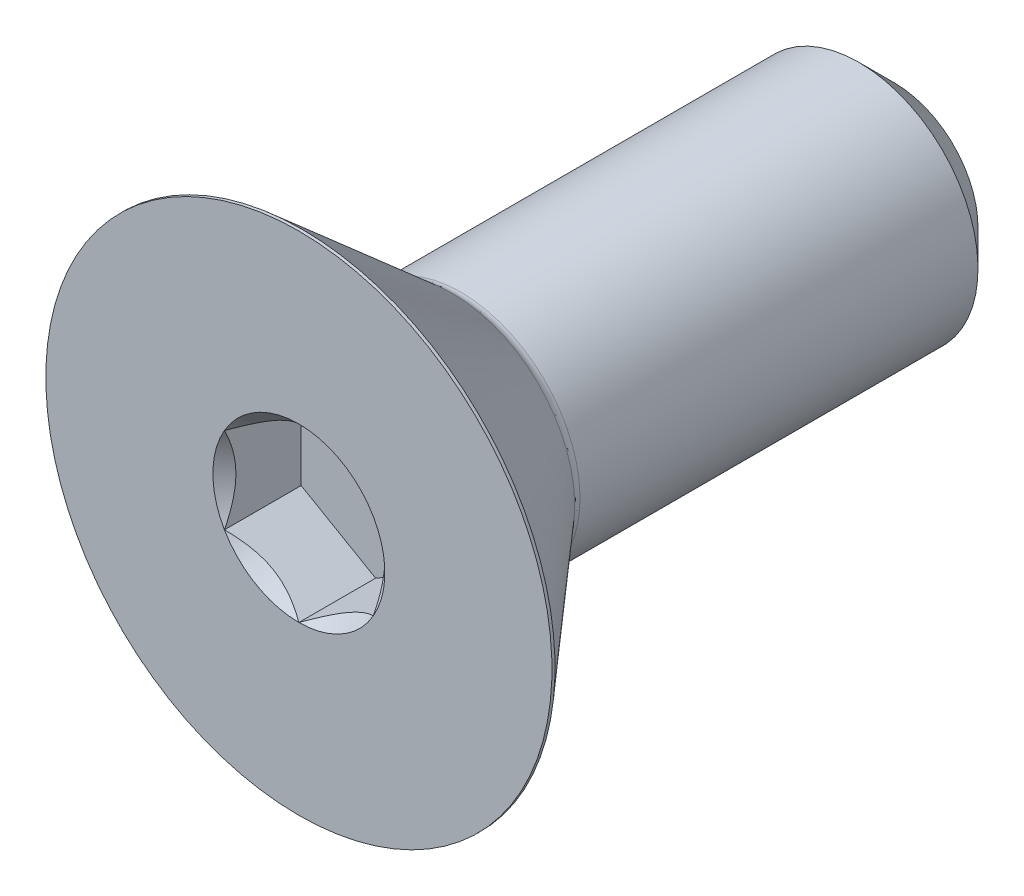
ISO-10303-21;
HEADER;
FILE_DESCRIPTION(('STEP AP214'),'2;1');
FILE_NAME('part.step','',(''),(''),'','','');
FILE_SCHEMA(('AUTOMOTIVE_DESIGN { 1 0 10303 214 1 1 1 1 }'));
ENDSEC;
DATA;
#1=APPLICATION_CONTEXT('core data for automotive mechanical design processes');
#2=APPLICATION_PROTOCOL_DEFINITION('international standard','automotive_design',2000,#1);
#3=PRODUCT_CONTEXT('',#1,'mechanical');
#4=PRODUCT('Part','Part','',(#3));
#5=PRODUCT_RELATED_PRODUCT_CATEGORY('part','',(#4));
#6=PRODUCT_DEFINITION_FORMATION('','',#4);
#7=PRODUCT_DEFINITION_CONTEXT('part definition',#1,'design');
#8=PRODUCT_DEFINITION('design','',#6,#7);
#9=PRODUCT_DEFINITION_SHAPE('','',#8);
#10=(LENGTH_UNIT() NAMED_UNIT(*) SI_UNIT(.MILLI.,.METRE.));
#11=(NAMED_UNIT(*) PLANE_ANGLE_UNIT() SI_UNIT($,.RADIAN.));
#12=(NAMED_UNIT(*) SI_UNIT($,.STERADIAN.) SOLID_ANGLE_UNIT());
#13=UNCERTAINTY_MEASURE_WITH_UNIT(LENGTH_MEASURE(1.E-05),#10,'distance_accuracy_value','');
#14=(GEOMETRIC_REPRESENTATION_CONTEXT(3) GLOBAL_UNCERTAINTY_ASSIGNED_CONTEXT((#13)) GLOBAL_UNIT_ASSIGNED_CONTEXT((#10,
#11,#12)) REPRESENTATION_CONTEXT('',''));
#15=CARTESIAN_POINT('',(0.,0.,0.));
#16=DIRECTION('',(0.,0.,1.));
#17=DIRECTION('',(1.,0.,0.));
#18=AXIS2_PLACEMENT_3D('',#15,#16,#17);
#19=CARTESIAN_POINT('',(0.,0.,7.9375));
#20=DIRECTION('',(0.,0.,1.));
#21=DIRECTION('',(1.,0.,0.));
#22=AXIS2_PLACEMENT_3D('',#19,#20,#21);
#23=CONICAL_SURFACE('',#22,2.29135888084633,0.78539816339745);
#24=CARTESIAN_POINT('',(0.,0.,7.9375));
#25=DIRECTION('',(0.,0.,1.));
#26=DIRECTION('',(1.,0.,0.));
#27=AXIS2_PLACEMENT_3D('',#24,#25,#26);
#28=CIRCLE('',#27,2.29135888084633);
#29=CARTESIAN_POINT('',(0.,-2.29135888084633,7.9375));
#30=VERTEX_POINT('',#29);
#31=CARTESIAN_POINT('',(1.984375,-1.14567944042316,7.9375));
#32=VERTEX_POINT('',#31);
#33=EDGE_CURVE('E238',#30,#32,#28,.T.);
#34=ORIENTED_EDGE('',*,*,#33,.T.);
#35=CARTESIAN_POINT('',(1.984575,-1.14556397036933,7.93761547878184));
#36=CARTESIAN_POINT('',(1.9163590048332,-1.18494849354192,7.89826285226392));
#37=CARTESIAN_POINT('',(1.84700231489303,-1.22499159714897,7.86122131044619));
#38=CARTESIAN_POINT('',(1.70557619954781,-1.30664400291398,7.79339885842332));
#39=CARTESIAN_POINT('',(1.63349332126322,-1.34826107209555,7.76265568909175));
#40=CARTESIAN_POINT('',(1.488141602734,-1.43217992591558,7.70999188881122));
#41=CARTESIAN_POINT('',(1.41490978751306,-1.47446033414663,7.68793887587996));
#42=CARTESIAN_POINT('',(1.2668338174053,-1.55995203534886,7.65396149294388));
#43=CARTESIAN_POINT('',(1.19199418724658,-1.60316071596705,7.64201175609173));
#44=CARTESIAN_POINT('',(1.06301458545619,-1.6776271237807,7.63123009908191));
#45=CARTESIAN_POINT('',(1.00904128422756,-1.7087886237741,7.62963389905907));
#46=CARTESIAN_POINT('',(0.901182881480201,-1.77106070163465,7.63232183886529));
#47=CARTESIAN_POINT('',(0.847297817514478,-1.80217125782056,7.63660804034046));
#48=CARTESIAN_POINT('',(0.740036461751398,-1.86409863044402,7.65081687301352));
#49=CARTESIAN_POINT('',(0.686660807239861,-1.89491507894443,7.66074581045227));
#50=CARTESIAN_POINT('',(0.580832482591105,-1.95601509066828,7.68569508427454));
#51=CARTESIAN_POINT('',(0.5283797420289,-1.9862986945516,7.70071503038949));
#52=CARTESIAN_POINT('',(0.394017661036353,-2.06387267818152,7.74530785163567));
#53=CARTESIAN_POINT('',(0.312941642841676,-2.11068193911104,7.77824299593833));
#54=CARTESIAN_POINT('',(0.193726693270161,-2.17951072233758,7.8338424412022));
#55=CARTESIAN_POINT('',(0.154440075613999,-2.20219286161692,7.85337759205186));
#56=CARTESIAN_POINT('',(0.0765946381319468,-2.24713694590237,7.8942287381194));
#57=CARTESIAN_POINT('',(0.038035388898301,-2.26939913882716,7.91554363956835));
#58=CARTESIAN_POINT('',(-0.000200000000000648,-2.29147435090017,7.93761547878184));
#59=B_SPLINE_CURVE_WITH_KNOTS('',3,(#35,#36,#37,#38,#39,#40,#41,#42,#43,#44,#45,#46,#47,#48,#49,
#50,#51,#52,#53,#54,#55,#56,#57,#58),.UNSPECIFIED.,.F.,.F.,(4,2,2,2,2,2,2,2,2,2,2,4),(0.,
0.264339630306626,0.530219665093693,0.791876416371459,1.05287424418109,1.239639843932,
1.42647091743852,1.61351120244034,1.8005371524754,2.09764209964316,2.24579179873714,
2.39385111134157),.UNSPECIFIED.);
#60=EDGE_CURVE('E11',#32,#30,#59,.T.);
#61=ORIENTED_EDGE('',*,*,#60,.T.);
#62=EDGE_LOOP('',(#34,#61));
#63=FACE_BOUND('',#62,.T.);
#64=ADVANCED_FACE('F39',(#63),#23,.F.);
#65=CARTESIAN_POINT('',(-1.984375,-1.14567944042316,7.9375));
#66=VERTEX_POINT('',#65);
#67=EDGE_CURVE('E243',#66,#30,#28,.T.);
#68=ORIENTED_EDGE('',*,*,#67,.T.);
#69=CARTESIAN_POINT('',(0.000199999999999503,-2.29147435090017,7.93761547878184));
#70=CARTESIAN_POINT('',(-0.0680159951668028,-2.25208982772758,7.89826285226392));
#71=CARTESIAN_POINT('',(-0.137372685106966,-2.21204672412052,7.86122131044619));
#72=CARTESIAN_POINT('',(-0.278798800452188,-2.13039431835551,7.79339885842332));
#73=CARTESIAN_POINT('',(-0.350881678736784,-2.08877724917394,7.76265568909175));
#74=CARTESIAN_POINT('',(-0.496233397266005,-2.00485839535392,7.70999188881122));
#75=CARTESIAN_POINT('',(-0.56946521248694,-1.96257798712287,7.68793887587996));
#76=CARTESIAN_POINT('',(-0.717541182594708,-1.87708628592063,7.65396149294388));
#77=CARTESIAN_POINT('',(-0.792380812753426,-1.83387760530244,7.64201175609173));
#78=CARTESIAN_POINT('',(-0.921360414543817,-1.75941119748879,7.63123009908191));
#79=CARTESIAN_POINT('',(-0.975333715772444,-1.72824969749539,7.62963389905907));
#80=CARTESIAN_POINT('',(-1.0831921185198,-1.66597761963484,7.63232183886529));
#81=CARTESIAN_POINT('',(-1.13707718248553,-1.63486706344893,7.63660804034046));
#82=CARTESIAN_POINT('',(-1.24433853824861,-1.57293969082547,7.65081687301352));
#83=CARTESIAN_POINT('',(-1.29771419276014,-1.54212324232506,7.66074581045227));
#84=CARTESIAN_POINT('',(-1.4035425174089,-1.48102323060122,7.68569508427454));
#85=CARTESIAN_POINT('',(-1.4559952579711,-1.45073962671789,7.70071503038949));
#86=CARTESIAN_POINT('',(-1.59035733896365,-1.37316564308797,7.74530785163567));
#87=CARTESIAN_POINT('',(-1.67143335715833,-1.32635638215845,7.77824299593833));
#88=CARTESIAN_POINT('',(-1.79064830672984,-1.25752759893191,7.8338424412022));
#89=CARTESIAN_POINT('',(-1.829934924386,-1.23484545965257,7.85337759205186));
#90=CARTESIAN_POINT('',(-1.90778036186805,-1.18990137536713,7.8942287381194));
#91=CARTESIAN_POINT('',(-1.9463396111017,-1.16763918244233,7.91554363956835));
#92=CARTESIAN_POINT('',(-1.984575,-1.14556397036933,7.93761547878184));
#93=B_SPLINE_CURVE_WITH_KNOTS('',3,(#69,#70,#71,#72,#73,#74,#75,#76,#77,#78,#79,#80,#81,#82,#83,
#84,#85,#86,#87,#88,#89,#90,#91,#92),.UNSPECIFIED.,.F.,.F.,(4,2,2,2,2,2,2,2,2,2,2,4),(0.,
0.264339630306627,0.530219665093695,0.791876416371461,1.05287424418109,1.239639843932,
1.42647091743852,1.61351120244035,1.80053715247541,2.09764209964316,2.24579179873714,
2.39385111134157),.UNSPECIFIED.);
#94=EDGE_CURVE('E53',#30,#66,#93,.T.);
#95=ORIENTED_EDGE('',*,*,#94,.T.);
#96=EDGE_LOOP('',(#68,#95));
#97=FACE_BOUND('',#96,.T.);
#98=ADVANCED_FACE('F228',(#97),#23,.F.);
#99=CARTESIAN_POINT('',(-1.984375,1.14567944042316,7.9375));
#100=VERTEX_POINT('',#99);
#101=EDGE_CURVE('E244',#100,#66,#28,.T.);
#102=ORIENTED_EDGE('',*,*,#101,.T.);
#103=CARTESIAN_POINT('',(-1.984375,-2.30930117448047,8.69090975651873));
#104=CARTESIAN_POINT('',(-1.984375,-2.25318066067427,8.64835431114607));
#105=CARTESIAN_POINT('',(-1.984375,-2.19674863292914,8.60620381978094));
#106=CARTESIAN_POINT('',(-1.984375,-2.08313770997735,8.52289293166334));
#107=CARTESIAN_POINT('',(-1.984375,-2.02595863330381,8.48173278264532));
#108=CARTESIAN_POINT('',(-1.984375,-1.91031146112746,8.40028994336285));
#109=CARTESIAN_POINT('',(-1.984375,-1.85183681291918,8.36001651479088));
#110=CARTESIAN_POINT('',(-1.984375,-1.73389897289164,8.28095506636812));
#111=CARTESIAN_POINT('',(-1.984375,-1.67443585088826,8.24216694224425));
#112=CARTESIAN_POINT('',(-1.984375,-1.48730697426244,8.12404893829194));
#113=CARTESIAN_POINT('',(-1.984375,-1.35764525006195,8.04782578623951));
#114=CARTESIAN_POINT('',(-1.984375,-1.09182473225155,7.90824026842669));
#115=CARTESIAN_POINT('',(-1.984375,-0.955689850924905,7.84483451681397));
#116=CARTESIAN_POINT('',(-1.984375,-0.751579681756423,7.76725639233767));
#117=CARTESIAN_POINT('',(-1.984375,-0.686679364431164,7.74503222861747));
#118=CARTESIAN_POINT('',(-1.984375,-0.555290823919295,7.70579140154786));
#119=CARTESIAN_POINT('',(-1.984375,-0.488802493715647,7.68877509023194));
#120=CARTESIAN_POINT('',(-1.984375,-0.35575770023226,7.66112428459052));
#121=CARTESIAN_POINT('',(-1.984375,-0.28922464265734,7.6503789491865));
#122=CARTESIAN_POINT('',(-1.984375,-0.155420132211981,7.63548382999268));
#123=CARTESIAN_POINT('',(-1.984375,-0.088148814201498,7.63133286114049));
#124=CARTESIAN_POINT('',(-1.984375,0.0439171579492899,7.62994504780904));
#125=CARTESIAN_POINT('',(-1.984375,0.108709202886916,7.63245250973426));
#126=CARTESIAN_POINT('',(-1.984375,0.237749869781508,7.64367340661066));
#127=CARTESIAN_POINT('',(-1.984375,0.301998439086573,7.65238743604135));
#128=CARTESIAN_POINT('',(-1.984375,0.430575076453288,7.67568953552594));
#129=CARTESIAN_POINT('',(-1.984375,0.494884590137217,7.69037842180613));
#130=CARTESIAN_POINT('',(-1.984375,0.622095496453364,7.72484221936127));
#131=CARTESIAN_POINT('',(-1.984375,0.684996997985222,7.74461673581143));
#132=CARTESIAN_POINT('',(-1.984375,0.88193610809939,7.81399789012513));
#133=CARTESIAN_POINT('',(-1.984375,1.01319755610918,7.87146047974145));
#134=CARTESIAN_POINT('',(-1.984375,1.26957386346612,7.99925178211845));
#135=CARTESIAN_POINT('',(-1.984375,1.39466464892634,8.06962649809791));
#136=CARTESIAN_POINT('',(-1.984375,1.5754711384894,8.17946869634988));
#137=CARTESIAN_POINT('',(-1.984375,1.63314521765824,8.21577557709467));
#138=CARTESIAN_POINT('',(-1.984375,1.74750339930581,8.28992795937257));
#139=CARTESIAN_POINT('',(-1.984375,1.80418742651566,8.32777357716684));
#140=CARTESIAN_POINT('',(-1.984375,1.91623595715125,8.40441000309552));
#141=CARTESIAN_POINT('',(-1.984375,1.97160742940914,8.44319067319145));
#142=CARTESIAN_POINT('',(-1.984375,2.0815928647001,8.52178133067531));
#143=CARTESIAN_POINT('',(-1.984375,2.13620703201304,8.56159103184811));
#144=CARTESIAN_POINT('',(-1.984375,2.19050397778737,8.60182239718879));
#145=B_SPLINE_CURVE_WITH_KNOTS('',3,(#103,#104,#105,#106,#107,#108,#109,#110,#111,#112,#113,
#114,#115,#116,#117,#118,#119,#120,#121,#122,#123,#124,#125,#126,#127,#128,#129,#130,#131,#132,
#133,#134,#135,#136,#137,#138,#139,#140,#141,#142,#143,#144),.UNSPECIFIED.,.F.,.F.,(4,2,2,2,2,2,
2,2,2,2,2,2,2,2,2,2,2,2,2,2,4),(0.,0.21129516542495,0.422642648151293,0.635626568171779,
0.848595508530639,1.29943391048318,1.74871972009351,1.95434592439722,2.15998602527965,
2.36187175164808,2.56372119337007,2.75793244551154,2.95216230216181,3.14981522249795,
3.34745280260615,3.77606500436223,4.2062350092677,4.4106671919865,4.61511484963914,
4.81790661958449,5.02064257931148),.UNSPECIFIED.);
#146=EDGE_CURVE('E202',#66,#100,#145,.T.);
#147=ORIENTED_EDGE('',*,*,#146,.T.);
#148=EDGE_LOOP('',(#102,#147));
#149=FACE_BOUND('',#148,.T.);
#150=ADVANCED_FACE('F234',(#149),#23,.F.);
#151=CARTESIAN_POINT('',(0.,2.29135888084633,7.9375));
#152=VERTEX_POINT('',#151);
#153=EDGE_CURVE('E146',#152,#100,#28,.T.);
#154=ORIENTED_EDGE('',*,*,#153,.T.);
#155=CARTESIAN_POINT('',(-1.984575,1.14556397036933,7.93761547878184));
#156=CARTESIAN_POINT('',(-1.9163590048332,1.18494849354192,7.89826285226392));
#157=CARTESIAN_POINT('',(-1.84700231489304,1.22499159714897,7.86122131044619));
#158=CARTESIAN_POINT('',(-1.70557619954781,1.30664400291398,7.79339885842332));
#159=CARTESIAN_POINT('',(-1.63349332126322,1.34826107209555,7.76265568909175));
#160=CARTESIAN_POINT('',(-1.488141602734,1.43217992591557,7.70999188881121));
#161=CARTESIAN_POINT('',(-1.41490978751306,1.47446033414663,7.68793887587996));
#162=CARTESIAN_POINT('',(-1.26683381740529,1.55995203534886,7.65396149294388));
#163=CARTESIAN_POINT('',(-1.19199418724658,1.60316071596705,7.64201175609173));
#164=CARTESIAN_POINT('',(-1.06301458545618,1.6776271237807,7.63123009908191));
#165=CARTESIAN_POINT('',(-1.00904128422756,1.7087886237741,7.62963389905907));
#166=CARTESIAN_POINT('',(-0.9011828814802,1.77106070163465,7.63232183886529));
#167=CARTESIAN_POINT('',(-0.847297817514477,1.80217125782056,7.63660804034046));
#168=CARTESIAN_POINT('',(-0.740036461751396,1.86409863044402,7.65081687301352));
#169=CARTESIAN_POINT('',(-0.686660807239859,1.89491507894443,7.66074581045227));
#170=CARTESIAN_POINT('',(-0.580832482591103,1.95601509066828,7.68569508427454));
#171=CARTESIAN_POINT('',(-0.528379742028898,1.9862986945516,7.70071503038949));
#172=CARTESIAN_POINT('',(-0.394017661036351,2.06387267818152,7.74530785163567));
#173=CARTESIAN_POINT('',(-0.312941642841676,2.11068193911104,7.77824299593833));
#174=CARTESIAN_POINT('',(-0.193726693270161,2.17951072233758,7.8338424412022));
#175=CARTESIAN_POINT('',(-0.154440075614,2.20219286161692,7.85337759205186));
#176=CARTESIAN_POINT('',(-0.0765946381319484,2.24713694590237,7.8942287381194));
#177=CARTESIAN_POINT('',(-0.0380353888983023,2.26939913882716,7.91554363956835));
#178=CARTESIAN_POINT('',(0.000199999999998974,2.29147435090017,7.93761547878184));
#179=B_SPLINE_CURVE_WITH_KNOTS('',3,(#155,#156,#157,#158,#159,#160,#161,#162,#163,#164,#165,
#166,#167,#168,#169,#170,#171,#172,#173,#174,#175,#176,#177,#178),.UNSPECIFIED.,.F.,.F.,(4,2,2,
2,2,2,2,2,2,2,2,4),(0.,0.264339630306626,0.530219665093694,0.791876416371461,1.05287424418109,
1.239639843932,1.42647091743852,1.61351120244035,1.8005371524754,2.09764209964316,
2.24579179873713,2.39385111134157),.UNSPECIFIED.);
#180=EDGE_CURVE('E110',#100,#152,#179,.T.);
#181=ORIENTED_EDGE('',*,*,#180,.T.);
#182=EDGE_LOOP('',(#154,#181));
#183=FACE_BOUND('',#182,.T.);
#184=ADVANCED_FACE('F257',(#183),#23,.F.);
#185=CARTESIAN_POINT('',(1.984375,1.14567944042316,7.9375));
#186=VERTEX_POINT('',#185);
#187=EDGE_CURVE('E142',#186,#152,#28,.T.);
#188=ORIENTED_EDGE('',*,*,#187,.T.);
#189=CARTESIAN_POINT('',(-0.000200000000000999,2.29147435090017,7.93761547878184));
#190=CARTESIAN_POINT('',(0.0680159951668019,2.25208982772757,7.89826285226391));
#191=CARTESIAN_POINT('',(0.137372685106966,2.21204672412052,7.86122131044618));
#192=CARTESIAN_POINT('',(0.278798800452187,2.13039431835551,7.79339885842332));
#193=CARTESIAN_POINT('',(0.350881678736782,2.08877724917394,7.76265568909175));
#194=CARTESIAN_POINT('',(0.496233397266003,2.00485839535392,7.70999188881121));
#195=CARTESIAN_POINT('',(0.569465212486938,1.96257798712287,7.68793887587996));
#196=CARTESIAN_POINT('',(0.717541182594705,1.87708628592063,7.65396149294388));
#197=CARTESIAN_POINT('',(0.792380812753424,1.83387760530244,7.64201175609173));
#198=CARTESIAN_POINT('',(0.921360414543815,1.75941119748879,7.6312300990819));
#199=CARTESIAN_POINT('',(0.975333715772441,1.72824969749539,7.62963389905907));
#200=CARTESIAN_POINT('',(1.0831921185198,1.66597761963484,7.63232183886529));
#201=CARTESIAN_POINT('',(1.13707718248552,1.63486706344893,7.63660804034046));
#202=CARTESIAN_POINT('',(1.2443385382486,1.57293969082547,7.65081687301352));
#203=CARTESIAN_POINT('',(1.29771419276014,1.54212324232506,7.66074581045227));
#204=CARTESIAN_POINT('',(1.4035425174089,1.48102323060122,7.68569508427454));
#205=CARTESIAN_POINT('',(1.4559952579711,1.45073962671789,7.70071503038949));
#206=CARTESIAN_POINT('',(1.59035733896365,1.37316564308797,7.74530785163567));
#207=CARTESIAN_POINT('',(1.67143335715832,1.32635638215845,7.77824299593833));
#208=CARTESIAN_POINT('',(1.79064830672984,1.25752759893191,7.8338424412022));
#209=CARTESIAN_POINT('',(1.829934924386,1.23484545965257,7.85337759205186));
#210=CARTESIAN_POINT('',(1.90778036186805,1.18990137536713,7.8942287381194));
#211=CARTESIAN_POINT('',(1.9463396111017,1.16763918244233,7.91554363956835));
#212=CARTESIAN_POINT('',(1.984575,1.14556397036933,7.93761547878184));
#213=B_SPLINE_CURVE_WITH_KNOTS('',3,(#189,#190,#191,#192,#193,#194,#195,#196,#197,#198,#199,
#200,#201,#202,#203,#204,#205,#206,#207,#208,#209,#210,#211,#212),.UNSPECIFIED.,.F.,.F.,(4,2,2,
2,2,2,2,2,2,2,2,4),(0.,0.264339630306628,0.530219665093694,0.79187641637146,1.05287424418109,
1.239639843932,1.42647091743852,1.61351120244035,1.8005371524754,2.09764209964316,
2.24579179873714,2.39385111134157),.UNSPECIFIED.);
#214=EDGE_CURVE('E172',#152,#186,#213,.T.);
#215=ORIENTED_EDGE('',*,*,#214,.T.);
#216=EDGE_LOOP('',(#188,#215));
#217=FACE_BOUND('',#216,.T.);
#218=ADVANCED_FACE('F189',(#217),#23,.F.);
#219=CARTESIAN_POINT('',(0.,0.,-7.9375));
#220=DIRECTION('',(0.,0.,-1.));
#221=DIRECTION('',(0.,1.,0.));
#222=AXIS2_PLACEMENT_3D('',#219,#220,#221);
#223=CYLINDRICAL_SURFACE('',#222,6.74370000000002);
#224=CARTESIAN_POINT('',(0.,0.,7.9375));
#225=DIRECTION('',(0.,0.,-1.));
#226=DIRECTION('',(0.,1.,0.));
#227=AXIS2_PLACEMENT_3D('',#224,#225,#226);
#228=CIRCLE('',#227,6.74370000000002);
#229=CARTESIAN_POINT('',(0.,6.7437,7.9375));
#230=VERTEX_POINT('',#229);
#231=EDGE_CURVE('E161',#230,#230,#228,.T.);
#232=ORIENTED_EDGE('',*,*,#231,.T.);
#233=EDGE_LOOP('',(#232));
#234=FACE_BOUND('',#233,.T.);
#235=CARTESIAN_POINT('',(0.,0.,7.855712));
#236=DIRECTION('',(0.,0.,-1.));
#237=DIRECTION('',(0.,1.,0.));
#238=AXIS2_PLACEMENT_3D('',#235,#236,#237);
#239=CIRCLE('',#238,6.74370000000002);
#240=CARTESIAN_POINT('',(0.,6.7437,7.855712));
#241=VERTEX_POINT('',#240);
#242=EDGE_CURVE('E145',#241,#241,#239,.T.);
#243=ORIENTED_EDGE('',*,*,#242,.F.);
#244=EDGE_LOOP('',(#243));
#245=FACE_BOUND('',#244,.T.);
#246=ADVANCED_FACE('F41',(#234,#245),#223,.T.);
#247=CARTESIAN_POINT('',(0.,0.,7.9375));
#248=DIRECTION('',(0.,0.,1.));
#249=DIRECTION('',(0.,-1.,0.));
#250=AXIS2_PLACEMENT_3D('',#247,#248,#249);
#251=PLANE('',#250);
#252=ORIENTED_EDGE('',*,*,#187,.F.);
#253=EDGE_CURVE('E135',#32,#186,#28,.T.);
#254=ORIENTED_EDGE('',*,*,#253,.F.);
#255=ORIENTED_EDGE('',*,*,#33,.F.);
#256=ORIENTED_EDGE('',*,*,#67,.F.);
#257=ORIENTED_EDGE('',*,*,#101,.F.);
#258=ORIENTED_EDGE('',*,*,#153,.F.);
#259=EDGE_LOOP('',(#252,#254,#255,#256,#257,#258));
#260=FACE_BOUND('',#259,.T.);
#261=ORIENTED_EDGE('',*,*,#231,.F.);
#262=EDGE_LOOP('',(#261));
#263=FACE_BOUND('',#262,.T.);
#264=ADVANCED_FACE('F248',(#260,#263),#251,.T.);
#265=CARTESIAN_POINT('',(0.,2.22249999999999,-7.9375));
#266=DIRECTION('',(0.,0.,-1.));
#267=DIRECTION('',(0.,1.,0.));
#268=AXIS2_PLACEMENT_3D('',#265,#266,#267);
#269=PLANE('',#268);
#270=CARTESIAN_POINT('',(0.,0.,-7.9375));
#271=DIRECTION('',(0.,0.,-1.));
#272=DIRECTION('',(0.,1.,0.));
#273=AXIS2_PLACEMENT_3D('',#270,#271,#272);
#274=CIRCLE('',#273,2.22250000000001);
#275=CARTESIAN_POINT('',(0.,2.22249999999999,-7.9375));
#276=VERTEX_POINT('',#275);
#277=EDGE_CURVE('E158',#276,#276,#274,.T.);
#278=ORIENTED_EDGE('',*,*,#277,.T.);
#279=EDGE_LOOP('',(#278));
#280=FACE_BOUND('',#279,.T.);
#281=ADVANCED_FACE('F317',(#280),#269,.T.);
#282=CARTESIAN_POINT('',(0.,0.,-7.9375));
#283=DIRECTION('',(0.,0.,1.));
#284=DIRECTION('',(0.,-1.,0.));
#285=AXIS2_PLACEMENT_3D('',#282,#283,#284);
#286=CONICAL_SURFACE('',#285,2.22250000000001,0.785398163397453);
#287=CARTESIAN_POINT('',(0.,0.,-6.985));
#288=DIRECTION('',(0.,0.,-1.));
#289=DIRECTION('',(0.,1.,0.));
#290=AXIS2_PLACEMENT_3D('',#287,#288,#289);
#291=CIRCLE('',#290,3.17500000000002);
#292=CARTESIAN_POINT('',(0.,3.175,-6.985));
#293=VERTEX_POINT('',#292);
#294=EDGE_CURVE('E155',#293,#293,#291,.T.);
#295=ORIENTED_EDGE('',*,*,#294,.T.);
#296=EDGE_LOOP('',(#295));
#297=FACE_BOUND('',#296,.T.);
#298=ORIENTED_EDGE('',*,*,#277,.F.);
#299=EDGE_LOOP('',(#298));
#300=FACE_BOUND('',#299,.T.);
#301=ADVANCED_FACE('F330',(#297,#300),#286,.T.);
#302=CARTESIAN_POINT('',(0.,0.,-7.9375));
#303=DIRECTION('',(0.,0.,-1.));
#304=DIRECTION('',(0.,1.,0.));
#305=AXIS2_PLACEMENT_3D('',#302,#303,#304);
#306=CYLINDRICAL_SURFACE('',#305,3.17500000000002);
#307=CARTESIAN_POINT('',(0.,0.,3.62092824692399));
#308=DIRECTION('',(0.,0.,-1.));
#309=DIRECTION('',(0.,1.,0.));
#310=AXIS2_PLACEMENT_3D('',#307,#308,#309);
#311=CIRCLE('',#310,3.17500000000002);
#312=CARTESIAN_POINT('',(0.,3.175,3.62092824692399));
#313=VERTEX_POINT('',#312);
#314=EDGE_CURVE('E152',#313,#313,#311,.T.);
#315=ORIENTED_EDGE('',*,*,#314,.T.);
#316=EDGE_LOOP('',(#315));
#317=FACE_BOUND('',#316,.T.);
#318=ORIENTED_EDGE('',*,*,#294,.F.);
#319=EDGE_LOOP('',(#318));
#320=FACE_BOUND('',#319,.T.);
#321=ADVANCED_FACE('F338',(#317,#320),#306,.T.);
#322=CARTESIAN_POINT('',(0.,0.,3.62092824692399));
#323=DIRECTION('',(0.,0.,-1.));
#324=DIRECTION('',(0.,1.,0.));
#325=AXIS2_PLACEMENT_3D('',#322,#323,#324);
#326=TOROIDAL_SURFACE('',#325,3.5212672458385,0.346267245838482);
#327=CARTESIAN_POINT('',(0.,0.,3.8481));
#328=DIRECTION('',(0.,0.,-1.));
#329=DIRECTION('',(0.,1.,0.));
#330=AXIS2_PLACEMENT_3D('',#327,#328,#329);
#331=CIRCLE('',#330,3.25993603808684);
#332=CARTESIAN_POINT('',(0.,3.25993603808683,3.8481));
#333=VERTEX_POINT('',#332);
#334=EDGE_CURVE('E149',#333,#333,#331,.T.);
#335=ORIENTED_EDGE('',*,*,#334,.T.);
#336=EDGE_LOOP('',(#335));
#337=FACE_BOUND('',#336,.T.);
#338=ORIENTED_EDGE('',*,*,#314,.F.);
#339=EDGE_LOOP('',(#338));
#340=FACE_BOUND('',#339,.T.);
#341=ADVANCED_FACE('F346',(#337,#340),#326,.F.);
#342=CARTESIAN_POINT('',(0.,0.,3.8481));
#343=DIRECTION('',(0.,0.,1.));
#344=DIRECTION('',(0.,-1.,0.));
#345=AXIS2_PLACEMENT_3D('',#342,#343,#344);
#346=CONICAL_SURFACE('',#345,3.25993603808684,0.715584993317677);
#347=ORIENTED_EDGE('',*,*,#242,.T.);
#348=EDGE_LOOP('',(#347));
#349=FACE_BOUND('',#348,.T.);
#350=ORIENTED_EDGE('',*,*,#334,.F.);
#351=EDGE_LOOP('',(#350));
#352=FACE_BOUND('',#351,.T.);
#353=ADVANCED_FACE('F187',(#349,#352),#346,.T.);
#354=ORIENTED_EDGE('',*,*,#253,.T.);
#355=CARTESIAN_POINT('',(1.984375,-2.30930117448048,8.69090975651874));
#356=CARTESIAN_POINT('',(1.984375,-2.25318066067428,8.64835431114607));
#357=CARTESIAN_POINT('',(1.984375,-2.19674863292914,8.60620381978095));
#358=CARTESIAN_POINT('',(1.984375,-2.08313770997735,8.52289293166334));
#359=CARTESIAN_POINT('',(1.984375,-2.02595863330381,8.48173278264532));
#360=CARTESIAN_POINT('',(1.984375,-1.91031146112747,8.40028994336286));
#361=CARTESIAN_POINT('',(1.984375,-1.85183681291918,8.36001651479088));
#362=CARTESIAN_POINT('',(1.984375,-1.73389897289165,8.28095506636812));
#363=CARTESIAN_POINT('',(1.984375,-1.67443585088826,8.24216694224425));
#364=CARTESIAN_POINT('',(1.984375,-1.48730697426244,8.12404893829195));
#365=CARTESIAN_POINT('',(1.984375,-1.35764525006195,8.04782578623952));
#366=CARTESIAN_POINT('',(1.984375,-1.09182473225155,7.90824026842669));
#367=CARTESIAN_POINT('',(1.984375,-0.955689850924906,7.84483451681397));
#368=CARTESIAN_POINT('',(1.984375,-0.751579681756424,7.76725639233767));
#369=CARTESIAN_POINT('',(1.984375,-0.686679364431165,7.74503222861747));
#370=CARTESIAN_POINT('',(1.984375,-0.555290823919296,7.70579140154786));
#371=CARTESIAN_POINT('',(1.984375,-0.488802493715649,7.68877509023194));
#372=CARTESIAN_POINT('',(1.984375,-0.355757700232262,7.66112428459052));
#373=CARTESIAN_POINT('',(1.984375,-0.289224642657341,7.6503789491865));
#374=CARTESIAN_POINT('',(1.984375,-0.155420132211982,7.63548382999268));
#375=CARTESIAN_POINT('',(1.984375,-0.0881488142014997,7.63133286114049));
#376=CARTESIAN_POINT('',(1.984375,0.0439171579492883,7.62994504780904));
#377=CARTESIAN_POINT('',(1.984375,0.108709202886915,7.63245250973426));
#378=CARTESIAN_POINT('',(1.984375,0.237749869781506,7.64367340661065));
#379=CARTESIAN_POINT('',(1.984375,0.301998439086572,7.65238743604135));
#380=CARTESIAN_POINT('',(1.984375,0.430575076453287,7.67568953552594));
#381=CARTESIAN_POINT('',(1.984375,0.494884590137217,7.69037842180613));
#382=CARTESIAN_POINT('',(1.984375,0.622095496453364,7.72484221936127));
#383=CARTESIAN_POINT('',(1.984375,0.684996997985222,7.74461673581143));
#384=CARTESIAN_POINT('',(1.984375,0.881936108099389,7.81399789012512));
#385=CARTESIAN_POINT('',(1.984375,1.01319755610917,7.87146047974145));
#386=CARTESIAN_POINT('',(1.984375,1.26957386346611,7.99925178211844));
#387=CARTESIAN_POINT('',(1.984375,1.39466464892634,8.0696264980979));
#388=CARTESIAN_POINT('',(1.984375,1.5754711384894,8.17946869634987));
#389=CARTESIAN_POINT('',(1.984375,1.63314521765823,8.21577557709467));
#390=CARTESIAN_POINT('',(1.984375,1.7475033993058,8.28992795937257));
#391=CARTESIAN_POINT('',(1.984375,1.80418742651565,8.32777357716684));
#392=CARTESIAN_POINT('',(1.984375,1.91623595715125,8.40441000309552));
#393=CARTESIAN_POINT('',(1.984375,1.97160742940914,8.44319067319144));
#394=CARTESIAN_POINT('',(1.984375,2.08159286470009,8.5217813306753));
#395=CARTESIAN_POINT('',(1.984375,2.13620703201303,8.5615910318481));
#396=CARTESIAN_POINT('',(1.984375,2.19050397778737,8.60182239718878));
#397=B_SPLINE_CURVE_WITH_KNOTS('',3,(#355,#356,#357,#358,#359,#360,#361,#362,#363,#364,#365,
#366,#367,#368,#369,#370,#371,#372,#373,#374,#375,#376,#377,#378,#379,#380,#381,#382,#383,#384,
#385,#386,#387,#388,#389,#390,#391,#392,#393,#394,#395,#396),.UNSPECIFIED.,.F.,.F.,(4,2,2,2,2,2,
2,2,2,2,2,2,2,2,2,2,2,2,2,2,4),(0.,0.21129516542495,0.422642648151295,0.635626568171781,
0.848595508530642,1.29943391048319,1.74871972009352,1.95434592439722,2.15998602527965,
2.36187175164808,2.56372119337008,2.75793244551155,2.95216230216182,3.14981522249795,
3.34745280260616,3.77606500436223,4.2062350092677,4.4106671919865,4.61511484963914,
4.81790661958449,5.02064257931148),.UNSPECIFIED.);
#398=EDGE_CURVE('E164',#186,#32,#397,.F.);
#399=ORIENTED_EDGE('',*,*,#398,.T.);
#400=EDGE_LOOP('',(#354,#399));
#401=FACE_BOUND('',#400,.T.);
#402=ADVANCED_FACE('F181',(#401),#23,.F.);
#403=CARTESIAN_POINT('',(0.,-2.29135888084633,5.8928));
#404=DIRECTION('',(0.5,-0.866025403784439,0.));
#405=DIRECTION('',(0.866025403784439,0.5,0.));
#406=AXIS2_PLACEMENT_3D('',#403,#404,#405);
#407=PLANE('',#406);
#408=DIRECTION('',(0.,0.,1.));
#409=VECTOR('',#408,1.);
#410=CARTESIAN_POINT('',(1.984375,-1.14567944042317,5.8928));
#411=LINE('',#410,#409);
#412=CARTESIAN_POINT('',(1.984375,-1.14567944042317,5.8928));
#413=VERTEX_POINT('',#412);
#414=EDGE_CURVE('E60',#413,#32,#411,.T.);
#415=ORIENTED_EDGE('',*,*,#414,.F.);
#416=DIRECTION('',(0.866025403784439,0.5,0.));
#417=VECTOR('',#416,1.);
#418=CARTESIAN_POINT('',(0.,-2.29135888084633,5.8928));
#419=LINE('',#418,#417);
#420=CARTESIAN_POINT('',(0.,-2.29135888084633,5.8928));
#421=VERTEX_POINT('',#420);
#422=EDGE_CURVE('E373',#421,#413,#419,.T.);
#423=ORIENTED_EDGE('',*,*,#422,.F.);
#424=DIRECTION('',(0.,0.,1.));
#425=VECTOR('',#424,1.);
#426=CARTESIAN_POINT('',(0.,-2.29135888084633,5.8928));
#427=LINE('',#426,#425);
#428=EDGE_CURVE('E69',#421,#30,#427,.T.);
#429=ORIENTED_EDGE('',*,*,#428,.T.);
#430=ORIENTED_EDGE('',*,*,#60,.F.);
#431=EDGE_LOOP('',(#415,#423,#429,#430));
#432=FACE_BOUND('',#431,.T.);
#433=ADVANCED_FACE('F186',(#432),#407,.F.);
#434=CARTESIAN_POINT('',(-1.984375,-1.14567944042316,5.8928));
#435=DIRECTION('',(-0.5,-0.866025403784439,0.));
#436=DIRECTION('',(0.866025403784439,-0.5,0.));
#437=AXIS2_PLACEMENT_3D('',#434,#435,#436);
#438=PLANE('',#437);
#439=ORIENTED_EDGE('',*,*,#428,.F.);
#440=DIRECTION('',(0.866025403784438,-0.5,0.));
#441=VECTOR('',#440,1.);
#442=CARTESIAN_POINT('',(-1.984375,-1.14567944042316,5.8928));
#443=LINE('',#442,#441);
#444=CARTESIAN_POINT('',(-1.984375,-1.14567944042316,5.8928));
#445=VERTEX_POINT('',#444);
#446=EDGE_CURVE('E121',#445,#421,#443,.T.);
#447=ORIENTED_EDGE('',*,*,#446,.F.);
#448=DIRECTION('',(0.,0.,1.));
#449=VECTOR('',#448,1.);
#450=CARTESIAN_POINT('',(-1.984375,-1.14567944042316,5.8928));
#451=LINE('',#450,#449);
#452=EDGE_CURVE('E113',#445,#66,#451,.T.);
#453=ORIENTED_EDGE('',*,*,#452,.T.);
#454=ORIENTED_EDGE('',*,*,#94,.F.);
#455=EDGE_LOOP('',(#439,#447,#453,#454));
#456=FACE_BOUND('',#455,.T.);
#457=ADVANCED_FACE('F213',(#456),#438,.F.);
#458=CARTESIAN_POINT('',(-1.984375,1.14567944042316,5.8928));
#459=DIRECTION('',(-1.,0.,0.));
#460=DIRECTION('',(0.,0.,1.));
#461=AXIS2_PLACEMENT_3D('',#458,#459,#460);
#462=PLANE('',#461);
#463=ORIENTED_EDGE('',*,*,#452,.F.);
#464=DIRECTION('',(0.,-1.,0.));
#465=VECTOR('',#464,1.);
#466=CARTESIAN_POINT('',(-1.984375,1.14567944042316,5.8928));
#467=LINE('',#466,#465);
#468=CARTESIAN_POINT('',(-1.984375,1.14567944042316,5.8928));
#469=VERTEX_POINT('',#468);
#470=EDGE_CURVE('E117',#469,#445,#467,.T.);
#471=ORIENTED_EDGE('',*,*,#470,.F.);
#472=DIRECTION('',(0.,0.,1.));
#473=VECTOR('',#472,1.);
#474=CARTESIAN_POINT('',(-1.984375,1.14567944042316,5.8928));
#475=LINE('',#474,#473);
#476=EDGE_CURVE('E102',#469,#100,#475,.T.);
#477=ORIENTED_EDGE('',*,*,#476,.T.);
#478=ORIENTED_EDGE('',*,*,#146,.F.);
#479=EDGE_LOOP('',(#463,#471,#477,#478));
#480=FACE_BOUND('',#479,.T.);
#481=ADVANCED_FACE('F118',(#480),#462,.F.);
#482=CARTESIAN_POINT('',(0.,2.29135888084633,5.8928));
#483=DIRECTION('',(-0.5,0.866025403784439,0.));
#484=DIRECTION('',(-0.866025403784439,-0.5,0.));
#485=AXIS2_PLACEMENT_3D('',#482,#483,#484);
#486=PLANE('',#485);
#487=ORIENTED_EDGE('',*,*,#476,.F.);
#488=DIRECTION('',(-0.866025403784439,-0.5,0.));
#489=VECTOR('',#488,1.);
#490=CARTESIAN_POINT('',(0.,2.29135888084633,5.8928));
#491=LINE('',#490,#489);
#492=CARTESIAN_POINT('',(0.,2.29135888084633,5.8928));
#493=VERTEX_POINT('',#492);
#494=EDGE_CURVE('E107',#493,#469,#491,.T.);
#495=ORIENTED_EDGE('',*,*,#494,.F.);
#496=DIRECTION('',(0.,0.,1.));
#497=VECTOR('',#496,1.);
#498=CARTESIAN_POINT('',(0.,2.29135888084633,5.8928));
#499=LINE('',#498,#497);
#500=EDGE_CURVE('E114',#493,#152,#499,.T.);
#501=ORIENTED_EDGE('',*,*,#500,.T.);
#502=ORIENTED_EDGE('',*,*,#180,.F.);
#503=EDGE_LOOP('',(#487,#495,#501,#502));
#504=FACE_BOUND('',#503,.T.);
#505=ADVANCED_FACE('F104',(#504),#486,.F.);
#506=CARTESIAN_POINT('',(1.984375,1.14567944042316,5.8928));
#507=DIRECTION('',(0.5,0.866025403784439,0.));
#508=DIRECTION('',(-0.866025403784439,0.5,0.));
#509=AXIS2_PLACEMENT_3D('',#506,#507,#508);
#510=PLANE('',#509);
#511=ORIENTED_EDGE('',*,*,#500,.F.);
#512=DIRECTION('',(-0.866025403784439,0.5,0.));
#513=VECTOR('',#512,1.);
#514=CARTESIAN_POINT('',(1.984375,1.14567944042316,5.8928));
#515=LINE('',#514,#513);
#516=CARTESIAN_POINT('',(1.984375,1.14567944042316,5.8928));
#517=VERTEX_POINT('',#516);
#518=EDGE_CURVE('E127',#517,#493,#515,.T.);
#519=ORIENTED_EDGE('',*,*,#518,.F.);
#520=DIRECTION('',(0.,0.,1.));
#521=VECTOR('',#520,1.);
#522=CARTESIAN_POINT('',(1.984375,1.14567944042316,5.8928));
#523=LINE('',#522,#521);
#524=EDGE_CURVE('E138',#517,#186,#523,.T.);
#525=ORIENTED_EDGE('',*,*,#524,.T.);
#526=ORIENTED_EDGE('',*,*,#214,.F.);
#527=EDGE_LOOP('',(#511,#519,#525,#526));
#528=FACE_BOUND('',#527,.T.);
#529=ADVANCED_FACE('F220',(#528),#510,.F.);
#530=CARTESIAN_POINT('',(1.984375,-1.14567944042317,5.8928));
#531=DIRECTION('',(1.,0.,0.));
#532=DIRECTION('',(0.,1.,0.));
#533=AXIS2_PLACEMENT_3D('',#530,#531,#532);
#534=PLANE('',#533);
#535=ORIENTED_EDGE('',*,*,#524,.F.);
#536=DIRECTION('',(0.,1.,0.));
#537=VECTOR('',#536,1.);
#538=CARTESIAN_POINT('',(1.984375,-1.14567944042317,5.8928));
#539=LINE('',#538,#537);
#540=EDGE_CURVE('E129',#413,#517,#539,.T.);
#541=ORIENTED_EDGE('',*,*,#540,.F.);
#542=ORIENTED_EDGE('',*,*,#414,.T.);
#543=ORIENTED_EDGE('',*,*,#398,.F.);
#544=EDGE_LOOP('',(#535,#541,#542,#543));
#545=FACE_BOUND('',#544,.T.);
#546=ADVANCED_FACE('F179',(#545),#534,.F.);
#547=CARTESIAN_POINT('',(0.,0.,5.8928));
#548=DIRECTION('',(0.,0.,1.));
#549=DIRECTION('',(1.,0.,0.));
#550=AXIS2_PLACEMENT_3D('',#547,#548,#549);
#551=PLANE('',#550);
#552=ORIENTED_EDGE('',*,*,#422,.T.);
#553=ORIENTED_EDGE('',*,*,#540,.T.);
#554=ORIENTED_EDGE('',*,*,#518,.T.);
#555=ORIENTED_EDGE('',*,*,#494,.T.);
#556=ORIENTED_EDGE('',*,*,#470,.T.);
#557=ORIENTED_EDGE('',*,*,#446,.T.);
#558=EDGE_LOOP('',(#552,#553,#554,#555,#556,#557));
#559=FACE_BOUND('',#558,.T.);
#560=ADVANCED_FACE('F124',(#559),#551,.T.);
#561=CLOSED_SHELL('',(#64,#98,#150,#184,#218,#246,#264,#281,#301,#321,#341,#353,#402,#433,#457,
#481,#505,#529,#546,#560));
#562=MANIFOLD_SOLID_BREP('B2',#561);
#563=ADVANCED_BREP_SHAPE_REPRESENTATION('',(#18,#562),#14);
#564=SHAPE_DEFINITION_REPRESENTATION(#9,#563);
ENDSEC;
END-ISO-10303-21;
